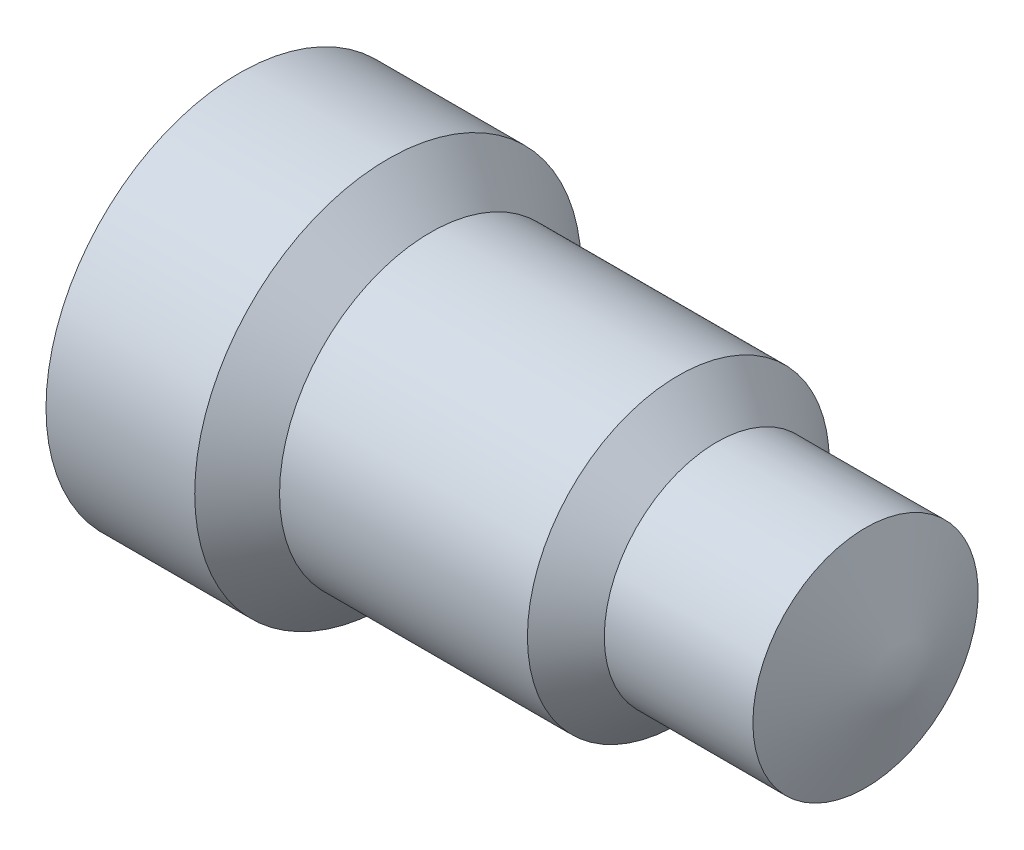
ISO-10303-21;
HEADER;
FILE_DESCRIPTION(('STEP AP214'),'2;1');
FILE_NAME('part.step','',(''),(''),'','','');
FILE_SCHEMA(('AUTOMOTIVE_DESIGN { 1 0 10303 214 1 1 1 1 }'));
ENDSEC;
DATA;
#1=APPLICATION_CONTEXT('core data for automotive mechanical design processes');
#2=APPLICATION_PROTOCOL_DEFINITION('international standard','automotive_design',2000,#1);
#3=PRODUCT_CONTEXT('',#1,'mechanical');
#4=PRODUCT('Part','Part','',(#3));
#5=PRODUCT_RELATED_PRODUCT_CATEGORY('part','',(#4));
#6=PRODUCT_DEFINITION_FORMATION('','',#4);
#7=PRODUCT_DEFINITION_CONTEXT('part definition',#1,'design');
#8=PRODUCT_DEFINITION('design','',#6,#7);
#9=PRODUCT_DEFINITION_SHAPE('','',#8);
#10=(LENGTH_UNIT() NAMED_UNIT(*) SI_UNIT(.MILLI.,.METRE.));
#11=(NAMED_UNIT(*) PLANE_ANGLE_UNIT() SI_UNIT($,.RADIAN.));
#12=(NAMED_UNIT(*) SI_UNIT($,.STERADIAN.) SOLID_ANGLE_UNIT());
#13=UNCERTAINTY_MEASURE_WITH_UNIT(LENGTH_MEASURE(1.E-05),#10,'distance_accuracy_value','');
#14=(GEOMETRIC_REPRESENTATION_CONTEXT(3) GLOBAL_UNCERTAINTY_ASSIGNED_CONTEXT((#13)) GLOBAL_UNIT_ASSIGNED_CONTEXT((#10,
#11,#12)) REPRESENTATION_CONTEXT('',''));
#15=CARTESIAN_POINT('',(0.,0.,0.));
#16=DIRECTION('',(0.,0.,1.));
#17=DIRECTION('',(1.,0.,0.));
#18=AXIS2_PLACEMENT_3D('',#15,#16,#17);
#19=CARTESIAN_POINT('',(0.,0.,0.));
#20=DIRECTION('',(1.,0.,0.));
#21=DIRECTION('',(0.,0.,-1.));
#22=AXIS2_PLACEMENT_3D('',#19,#20,#21);
#23=PLANE('',#22);
#24=CARTESIAN_POINT('',(0.,0.,0.));
#25=DIRECTION('',(-1.,0.,0.));
#26=DIRECTION('',(0.,0.,1.));
#27=AXIS2_PLACEMENT_3D('',#24,#25,#26);
#28=CIRCLE('',#27,49.53);
#29=CARTESIAN_POINT('',(0.,0.,49.53));
#30=VERTEX_POINT('',#29);
#31=EDGE_CURVE('E11',#30,#30,#28,.T.);
#32=ORIENTED_EDGE('',*,*,#31,.T.);
#33=EDGE_LOOP('',(#32));
#34=FACE_BOUND('',#33,.T.);
#35=ADVANCED_FACE('F33',(#34),#23,.F.);
#36=CARTESIAN_POINT('',(0.,0.,0.));
#37=DIRECTION('',(-1.,0.,0.));
#38=DIRECTION('',(0.,0.,1.));
#39=AXIS2_PLACEMENT_3D('',#36,#37,#38);
#40=CYLINDRICAL_SURFACE('',#39,49.53);
#41=ORIENTED_EDGE('',*,*,#31,.F.);
#42=EDGE_LOOP('',(#41));
#43=FACE_BOUND('',#42,.T.);
#44=CARTESIAN_POINT('',(38.1,0.,0.));
#45=DIRECTION('',(-1.,0.,0.));
#46=DIRECTION('',(0.,0.,1.));
#47=AXIS2_PLACEMENT_3D('',#44,#45,#46);
#48=CIRCLE('',#47,49.53);
#49=CARTESIAN_POINT('',(38.1,0.,49.53));
#50=VERTEX_POINT('',#49);
#51=EDGE_CURVE('E39',#50,#50,#48,.T.);
#52=ORIENTED_EDGE('',*,*,#51,.T.);
#53=EDGE_LOOP('',(#52));
#54=FACE_BOUND('',#53,.T.);
#55=ADVANCED_FACE('F55',(#43,#54),#40,.T.);
#56=CARTESIAN_POINT('',(48.9762150289775,0.,0.));
#57=DIRECTION('',(-1.,0.,0.));
#58=DIRECTION('',(0.,0.,1.));
#59=AXIS2_PLACEMENT_3D('',#56,#57,#58);
#60=CONICAL_SURFACE('',#59,38.6743076254257,0.784453807804476);
#61=ORIENTED_EDGE('',*,*,#51,.F.);
#62=EDGE_LOOP('',(#61));
#63=FACE_BOUND('',#62,.T.);
#64=CARTESIAN_POINT('',(48.9762150289775,0.,0.));
#65=DIRECTION('',(-1.,0.,0.));
#66=DIRECTION('',(0.,0.,1.));
#67=AXIS2_PLACEMENT_3D('',#64,#65,#66);
#68=CIRCLE('',#67,38.6743076254257);
#69=CARTESIAN_POINT('',(48.9762150289775,0.,38.6743076254257));
#70=VERTEX_POINT('',#69);
#71=EDGE_CURVE('E67',#70,#70,#68,.T.);
#72=ORIENTED_EDGE('',*,*,#71,.T.);
#73=EDGE_LOOP('',(#72));
#74=FACE_BOUND('',#73,.T.);
#75=ADVANCED_FACE('F60',(#63,#74),#60,.T.);
#76=CARTESIAN_POINT('',(0.,0.,0.));
#77=DIRECTION('',(-1.,0.,0.));
#78=DIRECTION('',(0.,0.,1.));
#79=AXIS2_PLACEMENT_3D('',#76,#77,#78);
#80=CYLINDRICAL_SURFACE('',#79,38.6743076254257);
#81=ORIENTED_EDGE('',*,*,#71,.F.);
#82=EDGE_LOOP('',(#81));
#83=FACE_BOUND('',#82,.T.);
#84=CARTESIAN_POINT('',(112.476215028978,0.,0.));
#85=DIRECTION('',(-1.,0.,0.));
#86=DIRECTION('',(0.,0.,1.));
#87=AXIS2_PLACEMENT_3D('',#84,#85,#86);
#88=CIRCLE('',#87,38.6743076254257);
#89=CARTESIAN_POINT('',(112.476215028978,0.,38.6743076254257));
#90=VERTEX_POINT('',#89);
#91=EDGE_CURVE('E69',#90,#90,#88,.T.);
#92=ORIENTED_EDGE('',*,*,#91,.T.);
#93=EDGE_LOOP('',(#92));
#94=FACE_BOUND('',#93,.T.);
#95=ADVANCED_FACE('F83',(#83,#94),#80,.T.);
#96=CARTESIAN_POINT('',(122.322199049792,0.,0.));
#97=DIRECTION('',(-1.,0.,0.));
#98=DIRECTION('',(0.,0.,1.));
#99=AXIS2_PLACEMENT_3D('',#96,#97,#98);
#100=CONICAL_SURFACE('',#99,28.8283236046113,0.785398163397449);
#101=ORIENTED_EDGE('',*,*,#91,.F.);
#102=EDGE_LOOP('',(#101));
#103=FACE_BOUND('',#102,.T.);
#104=CARTESIAN_POINT('',(122.322199049792,0.,0.));
#105=DIRECTION('',(-1.,0.,0.));
#106=DIRECTION('',(0.,0.,1.));
#107=AXIS2_PLACEMENT_3D('',#104,#105,#106);
#108=CIRCLE('',#107,28.8283236046113);
#109=CARTESIAN_POINT('',(122.322199049792,0.,28.8283236046113));
#110=VERTEX_POINT('',#109);
#111=EDGE_CURVE('E74',#110,#110,#108,.T.);
#112=ORIENTED_EDGE('',*,*,#111,.T.);
#113=EDGE_LOOP('',(#112));
#114=FACE_BOUND('',#113,.T.);
#115=ADVANCED_FACE('F50',(#103,#114),#100,.T.);
#116=CARTESIAN_POINT('',(160.422199049792,0.,0.));
#117=DIRECTION('',(1.,0.,0.));
#118=DIRECTION('',(0.,0.,-1.));
#119=AXIS2_PLACEMENT_3D('',#116,#117,#118);
#120=CONICAL_SURFACE('',#119,28.858545587228,0.000793227723830608);
#121=ORIENTED_EDGE('',*,*,#111,.F.);
#122=EDGE_LOOP('',(#121));
#123=FACE_BOUND('',#122,.T.);
#124=CARTESIAN_POINT('',(160.422199049792,0.,0.));
#125=DIRECTION('',(-1.,0.,0.));
#126=DIRECTION('',(0.,0.,1.));
#127=AXIS2_PLACEMENT_3D('',#124,#125,#126);
#128=CIRCLE('',#127,28.858545587228);
#129=CARTESIAN_POINT('',(160.422199049792,0.,28.858545587228));
#130=VERTEX_POINT('',#129);
#131=EDGE_CURVE('E77',#130,#130,#128,.T.);
#132=ORIENTED_EDGE('',*,*,#131,.T.);
#133=EDGE_LOOP('',(#132));
#134=FACE_BOUND('',#133,.T.);
#135=ADVANCED_FACE('F44',(#123,#134),#120,.T.);
#136=CARTESIAN_POINT('',(171.45,0.,0.));
#137=DIRECTION('',(-1.,0.,0.));
#138=DIRECTION('',(0.,0.,1.));
#139=AXIS2_PLACEMENT_3D('',#136,#137,#138);
#140=CONICAL_SURFACE('',#139,0.,1.20578682929659);
#141=ORIENTED_EDGE('',*,*,#131,.F.);
#142=EDGE_LOOP('',(#141));
#143=FACE_BOUND('',#142,.T.);
#144=CARTESIAN_POINT('',(171.45,0.,0.));
#145=VERTEX_POINT('',#144);
#146=VERTEX_LOOP('',#145);
#147=FACE_BOUND('',#146,.T.);
#148=ADVANCED_FACE('F42',(#143,#147),#140,.T.);
#149=CLOSED_SHELL('',(#35,#55,#75,#95,#115,#135,#148));
#150=MANIFOLD_SOLID_BREP('B2',#149);
#151=ADVANCED_BREP_SHAPE_REPRESENTATION('',(#18,#150),#14);
#152=SHAPE_DEFINITION_REPRESENTATION(#9,#151);
ENDSEC;
END-ISO-10303-21;
